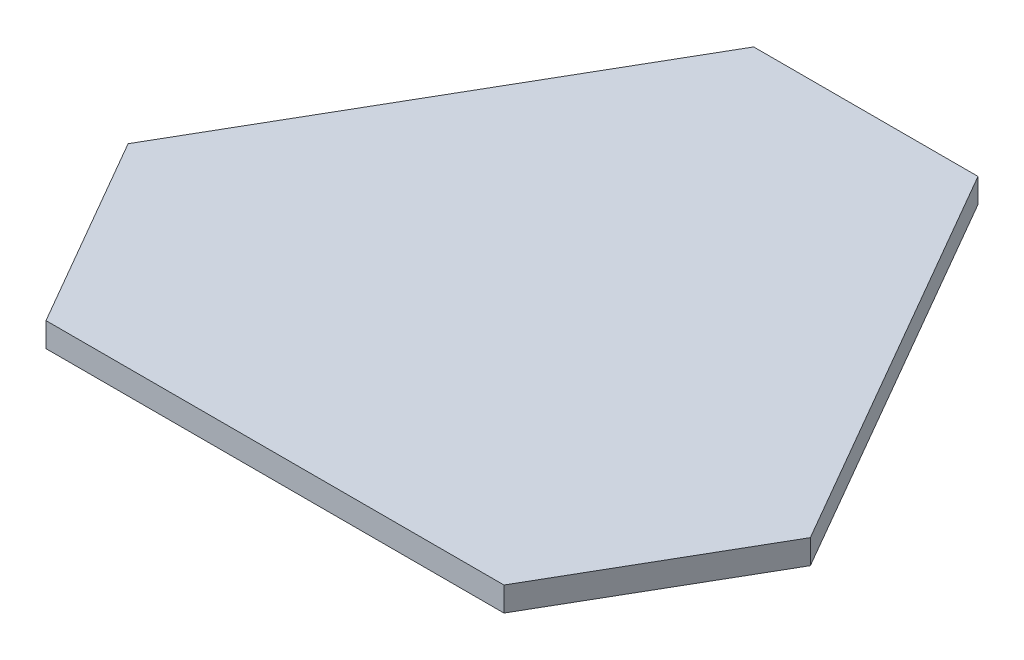
ISO-10303-21;
HEADER;
FILE_DESCRIPTION(('STEP AP214'),'2;1');
FILE_NAME('part.step','',(''),(''),'','','');
FILE_SCHEMA(('AUTOMOTIVE_DESIGN { 1 0 10303 214 1 1 1 1 }'));
ENDSEC;
DATA;
#1=APPLICATION_CONTEXT('core data for automotive mechanical design processes');
#2=APPLICATION_PROTOCOL_DEFINITION('international standard','automotive_design',2000,#1);
#3=PRODUCT_CONTEXT('',#1,'mechanical');
#4=PRODUCT('Part','Part','',(#3));
#5=PRODUCT_RELATED_PRODUCT_CATEGORY('part','',(#4));
#6=PRODUCT_DEFINITION_FORMATION('','',#4);
#7=PRODUCT_DEFINITION_CONTEXT('part definition',#1,'design');
#8=PRODUCT_DEFINITION('design','',#6,#7);
#9=PRODUCT_DEFINITION_SHAPE('','',#8);
#10=(LENGTH_UNIT() NAMED_UNIT(*) SI_UNIT(.MILLI.,.METRE.));
#11=(NAMED_UNIT(*) PLANE_ANGLE_UNIT() SI_UNIT($,.RADIAN.));
#12=(NAMED_UNIT(*) SI_UNIT($,.STERADIAN.) SOLID_ANGLE_UNIT());
#13=UNCERTAINTY_MEASURE_WITH_UNIT(LENGTH_MEASURE(1.E-05),#10,'distance_accuracy_value','');
#14=(GEOMETRIC_REPRESENTATION_CONTEXT(3) GLOBAL_UNCERTAINTY_ASSIGNED_CONTEXT((#13)) GLOBAL_UNIT_ASSIGNED_CONTEXT((#10,
#11,#12)) REPRESENTATION_CONTEXT('',''));
#15=CARTESIAN_POINT('',(0.,0.,0.));
#16=DIRECTION('',(0.,0.,1.));
#17=DIRECTION('',(1.,0.,0.));
#18=AXIS2_PLACEMENT_3D('',#15,#16,#17);
#19=CARTESIAN_POINT('',(28.2593681321498,123.,32.2963159117586));
#20=DIRECTION('',(-0.866025403784438,0.,-0.5));
#21=DIRECTION('',(-0.5,0.,0.866025403784439));
#22=AXIS2_PLACEMENT_3D('',#19,#20,#21);
#23=PLANE('',#22);
#24=DIRECTION('',(0.5,0.,-0.866025403784439));
#25=VECTOR('',#24,1.);
#26=CARTESIAN_POINT('',(28.2593681321498,120.,32.2963159117586));
#27=LINE('',#26,#25);
#28=CARTESIAN_POINT('',(28.2593681321498,120.,32.2963159117586));
#29=VERTEX_POINT('',#28);
#30=CARTESIAN_POINT('',(42.0991140943054,120.,8.32517274145887));
#31=VERTEX_POINT('',#30);
#32=EDGE_CURVE('E125',#29,#31,#27,.T.);
#33=ORIENTED_EDGE('',*,*,#32,.T.);
#34=DIRECTION('',(0.,-1.,0.));
#35=VECTOR('',#34,1.);
#36=CARTESIAN_POINT('',(42.0991140943054,123.,8.32517274145887));
#37=LINE('',#36,#35);
#38=CARTESIAN_POINT('',(42.0991140943054,123.,8.32517274145887));
#39=VERTEX_POINT('',#38);
#40=EDGE_CURVE('E11',#39,#31,#37,.T.);
#41=ORIENTED_EDGE('',*,*,#40,.F.);
#42=DIRECTION('',(0.5,0.,-0.866025403784439));
#43=VECTOR('',#42,1.);
#44=CARTESIAN_POINT('',(28.2593681321498,123.,32.2963159117586));
#45=LINE('',#44,#43);
#46=CARTESIAN_POINT('',(28.2593681321498,123.,32.2963159117586));
#47=VERTEX_POINT('',#46);
#48=EDGE_CURVE('E135',#47,#39,#45,.T.);
#49=ORIENTED_EDGE('',*,*,#48,.F.);
#50=DIRECTION('',(0.,-1.,0.));
#51=VECTOR('',#50,1.);
#52=CARTESIAN_POINT('',(28.2593681321498,123.,32.2963159117586));
#53=LINE('',#52,#51);
#54=EDGE_CURVE('E121',#47,#29,#53,.T.);
#55=ORIENTED_EDGE('',*,*,#54,.T.);
#56=EDGE_LOOP('',(#33,#41,#49,#55));
#57=FACE_BOUND('',#56,.T.);
#58=ADVANCED_FACE('F41',(#57),#23,.F.);
#59=CARTESIAN_POINT('',(42.0991140943054,123.,8.32517274145887));
#60=DIRECTION('',(-0.866025403784439,0.,0.5));
#61=DIRECTION('',(0.5,0.,0.866025403784439));
#62=AXIS2_PLACEMENT_3D('',#59,#60,#61);
#63=PLANE('',#62);
#64=DIRECTION('',(-0.5,0.,-0.866025403784439));
#65=VECTOR('',#64,1.);
#66=CARTESIAN_POINT('',(42.0991140943054,120.,8.32517274145887));
#67=LINE('',#66,#65);
#68=CARTESIAN_POINT('',(13.8397459621556,120.,-40.6214886532175));
#69=VERTEX_POINT('',#68);
#70=EDGE_CURVE('E128',#31,#69,#67,.T.);
#71=ORIENTED_EDGE('',*,*,#70,.T.);
#72=DIRECTION('',(0.,-1.,0.));
#73=VECTOR('',#72,1.);
#74=CARTESIAN_POINT('',(13.8397459621556,123.,-40.6214886532175));
#75=LINE('',#74,#73);
#76=CARTESIAN_POINT('',(13.8397459621556,123.,-40.6214886532175));
#77=VERTEX_POINT('',#76);
#78=EDGE_CURVE('E49',#77,#69,#75,.T.);
#79=ORIENTED_EDGE('',*,*,#78,.F.);
#80=DIRECTION('',(-0.5,0.,-0.866025403784439));
#81=VECTOR('',#80,1.);
#82=CARTESIAN_POINT('',(42.0991140943054,123.,8.32517274145887));
#83=LINE('',#82,#81);
#84=EDGE_CURVE('E94',#39,#77,#83,.T.);
#85=ORIENTED_EDGE('',*,*,#84,.F.);
#86=ORIENTED_EDGE('',*,*,#40,.T.);
#87=EDGE_LOOP('',(#71,#79,#85,#86));
#88=FACE_BOUND('',#87,.T.);
#89=ADVANCED_FACE('F160',(#88),#63,.F.);
#90=CARTESIAN_POINT('',(13.8397459621556,123.,-40.6214886532175));
#91=DIRECTION('',(0.,0.,1.));
#92=DIRECTION('',(1.,0.,0.));
#93=AXIS2_PLACEMENT_3D('',#90,#91,#92);
#94=PLANE('',#93);
#95=DIRECTION('',(-1.,0.,0.));
#96=VECTOR('',#95,1.);
#97=CARTESIAN_POINT('',(13.8397459621556,120.,-40.6214886532175));
#98=LINE('',#97,#96);
#99=CARTESIAN_POINT('',(-13.8397459621556,120.,-40.6214886532175));
#100=VERTEX_POINT('',#99);
#101=EDGE_CURVE('E130',#69,#100,#98,.T.);
#102=ORIENTED_EDGE('',*,*,#101,.T.);
#103=DIRECTION('',(0.,-1.,0.));
#104=VECTOR('',#103,1.);
#105=CARTESIAN_POINT('',(-13.8397459621556,123.,-40.6214886532175));
#106=LINE('',#105,#104);
#107=CARTESIAN_POINT('',(-13.8397459621556,123.,-40.6214886532175));
#108=VERTEX_POINT('',#107);
#109=EDGE_CURVE('E116',#108,#100,#106,.T.);
#110=ORIENTED_EDGE('',*,*,#109,.F.);
#111=DIRECTION('',(-1.,0.,0.));
#112=VECTOR('',#111,1.);
#113=CARTESIAN_POINT('',(13.8397459621556,123.,-40.6214886532175));
#114=LINE('',#113,#112);
#115=EDGE_CURVE('E107',#77,#108,#114,.T.);
#116=ORIENTED_EDGE('',*,*,#115,.F.);
#117=ORIENTED_EDGE('',*,*,#78,.T.);
#118=EDGE_LOOP('',(#102,#110,#116,#117));
#119=FACE_BOUND('',#118,.T.);
#120=ADVANCED_FACE('F141',(#119),#94,.F.);
#121=CARTESIAN_POINT('',(-13.8397459621556,123.,-40.6214886532175));
#122=DIRECTION('',(0.866025403784439,0.,0.5));
#123=DIRECTION('',(0.5,0.,-0.866025403784439));
#124=AXIS2_PLACEMENT_3D('',#121,#122,#123);
#125=PLANE('',#124);
#126=DIRECTION('',(-0.5,0.,0.866025403784439));
#127=VECTOR('',#126,1.);
#128=CARTESIAN_POINT('',(-13.8397459621556,120.,-40.6214886532175));
#129=LINE('',#128,#127);
#130=CARTESIAN_POINT('',(-42.0991140943054,120.,8.32517274145887));
#131=VERTEX_POINT('',#130);
#132=EDGE_CURVE('E115',#100,#131,#129,.T.);
#133=ORIENTED_EDGE('',*,*,#132,.T.);
#134=DIRECTION('',(0.,-1.,0.));
#135=VECTOR('',#134,1.);
#136=CARTESIAN_POINT('',(-42.0991140943054,123.,8.32517274145887));
#137=LINE('',#136,#135);
#138=CARTESIAN_POINT('',(-42.0991140943054,123.,8.32517274145887));
#139=VERTEX_POINT('',#138);
#140=EDGE_CURVE('E112',#139,#131,#137,.T.);
#141=ORIENTED_EDGE('',*,*,#140,.F.);
#142=DIRECTION('',(-0.5,0.,0.866025403784439));
#143=VECTOR('',#142,1.);
#144=CARTESIAN_POINT('',(-13.8397459621556,123.,-40.6214886532175));
#145=LINE('',#144,#143);
#146=EDGE_CURVE('E101',#108,#139,#145,.T.);
#147=ORIENTED_EDGE('',*,*,#146,.F.);
#148=ORIENTED_EDGE('',*,*,#109,.T.);
#149=EDGE_LOOP('',(#133,#141,#147,#148));
#150=FACE_BOUND('',#149,.T.);
#151=ADVANCED_FACE('F113',(#150),#125,.F.);
#152=CARTESIAN_POINT('',(-42.0991140943054,123.,8.32517274145887));
#153=DIRECTION('',(0.866025403784438,0.,-0.5));
#154=DIRECTION('',(-0.5,0.,-0.866025403784439));
#155=AXIS2_PLACEMENT_3D('',#152,#153,#154);
#156=PLANE('',#155);
#157=DIRECTION('',(0.5,0.,0.866025403784439));
#158=VECTOR('',#157,1.);
#159=CARTESIAN_POINT('',(-42.0991140943054,120.,8.32517274145887));
#160=LINE('',#159,#158);
#161=CARTESIAN_POINT('',(-28.2593681321498,120.,32.2963159117586));
#162=VERTEX_POINT('',#161);
#163=EDGE_CURVE('E80',#131,#162,#160,.T.);
#164=ORIENTED_EDGE('',*,*,#163,.T.);
#165=DIRECTION('',(0.,-1.,0.));
#166=VECTOR('',#165,1.);
#167=CARTESIAN_POINT('',(-28.2593681321498,123.,32.2963159117586));
#168=LINE('',#167,#166);
#169=CARTESIAN_POINT('',(-28.2593681321498,123.,32.2963159117586));
#170=VERTEX_POINT('',#169);
#171=EDGE_CURVE('E117',#170,#162,#168,.T.);
#172=ORIENTED_EDGE('',*,*,#171,.F.);
#173=DIRECTION('',(0.5,0.,0.866025403784439));
#174=VECTOR('',#173,1.);
#175=CARTESIAN_POINT('',(-42.0991140943054,123.,8.32517274145887));
#176=LINE('',#175,#174);
#177=EDGE_CURVE('E105',#139,#170,#176,.T.);
#178=ORIENTED_EDGE('',*,*,#177,.F.);
#179=ORIENTED_EDGE('',*,*,#140,.T.);
#180=EDGE_LOOP('',(#164,#172,#178,#179));
#181=FACE_BOUND('',#180,.T.);
#182=ADVANCED_FACE('F119',(#181),#156,.F.);
#183=CARTESIAN_POINT('',(-28.2593681321498,123.,32.2963159117586));
#184=DIRECTION('',(0.,0.,-1.));
#185=DIRECTION('',(-1.,0.,0.));
#186=AXIS2_PLACEMENT_3D('',#183,#184,#185);
#187=PLANE('',#186);
#188=DIRECTION('',(1.,0.,0.));
#189=VECTOR('',#188,1.);
#190=CARTESIAN_POINT('',(-28.2593681321498,120.,32.2963159117586));
#191=LINE('',#190,#189);
#192=EDGE_CURVE('E86',#162,#29,#191,.T.);
#193=ORIENTED_EDGE('',*,*,#192,.T.);
#194=ORIENTED_EDGE('',*,*,#54,.F.);
#195=DIRECTION('',(1.,0.,0.));
#196=VECTOR('',#195,1.);
#197=CARTESIAN_POINT('',(-28.2593681321498,123.,32.2963159117586));
#198=LINE('',#197,#196);
#199=EDGE_CURVE('E57',#170,#47,#198,.T.);
#200=ORIENTED_EDGE('',*,*,#199,.F.);
#201=ORIENTED_EDGE('',*,*,#171,.T.);
#202=EDGE_LOOP('',(#193,#194,#200,#201));
#203=FACE_BOUND('',#202,.T.);
#204=ADVANCED_FACE('F148',(#203),#187,.F.);
#205=CARTESIAN_POINT('',(0.,123.,0.));
#206=DIRECTION('',(0.,1.,0.));
#207=DIRECTION('',(0.,0.,1.));
#208=AXIS2_PLACEMENT_3D('',#205,#206,#207);
#209=PLANE('',#208);
#210=ORIENTED_EDGE('',*,*,#48,.T.);
#211=ORIENTED_EDGE('',*,*,#84,.T.);
#212=ORIENTED_EDGE('',*,*,#115,.T.);
#213=ORIENTED_EDGE('',*,*,#146,.T.);
#214=ORIENTED_EDGE('',*,*,#177,.T.);
#215=ORIENTED_EDGE('',*,*,#199,.T.);
#216=EDGE_LOOP('',(#210,#211,#212,#213,#214,#215));
#217=FACE_BOUND('',#216,.T.);
#218=ADVANCED_FACE('F103',(#217),#209,.T.);
#219=CARTESIAN_POINT('',(0.,120.,0.));
#220=DIRECTION('',(0.,1.,0.));
#221=DIRECTION('',(0.,0.,1.));
#222=AXIS2_PLACEMENT_3D('',#219,#220,#221);
#223=PLANE('',#222);
#224=ORIENTED_EDGE('',*,*,#32,.F.);
#225=ORIENTED_EDGE('',*,*,#192,.F.);
#226=ORIENTED_EDGE('',*,*,#163,.F.);
#227=ORIENTED_EDGE('',*,*,#132,.F.);
#228=ORIENTED_EDGE('',*,*,#101,.F.);
#229=ORIENTED_EDGE('',*,*,#70,.F.);
#230=EDGE_LOOP('',(#224,#225,#226,#227,#228,#229));
#231=FACE_BOUND('',#230,.T.);
#232=ADVANCED_FACE('F144',(#231),#223,.F.);
#233=CLOSED_SHELL('',(#58,#89,#120,#151,#182,#204,#218,#232));
#234=MANIFOLD_SOLID_BREP('B2',#233);
#235=ADVANCED_BREP_SHAPE_REPRESENTATION('',(#18,#234),#14);
#236=SHAPE_DEFINITION_REPRESENTATION(#9,#235);
ENDSEC;
END-ISO-10303-21;
